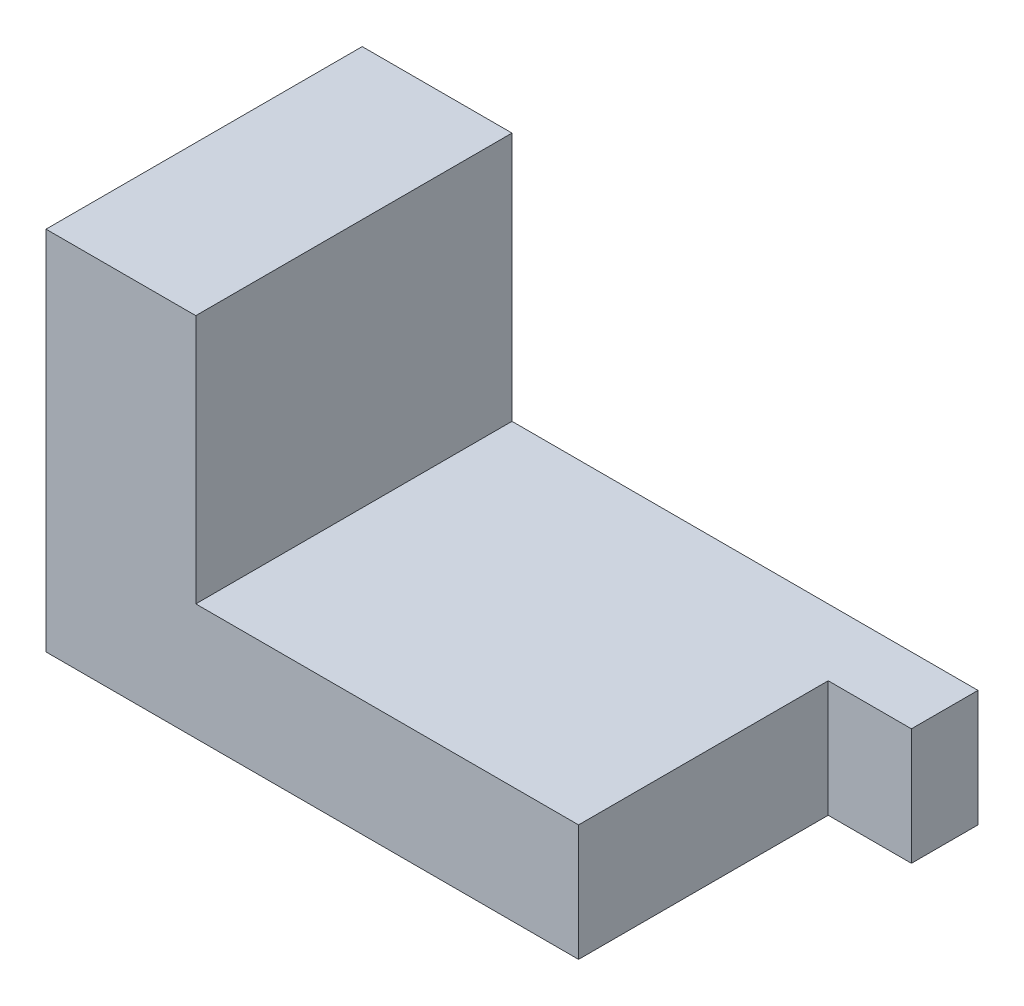
ISO-10303-21;
HEADER;
FILE_DESCRIPTION(('STEP AP214'),'2;1');
FILE_NAME('part.step','',(''),(''),'','','');
FILE_SCHEMA(('AUTOMOTIVE_DESIGN { 1 0 10303 214 1 1 1 1 }'));
ENDSEC;
DATA;
#1=APPLICATION_CONTEXT('core data for automotive mechanical design processes');
#2=APPLICATION_PROTOCOL_DEFINITION('international standard','automotive_design',2000,#1);
#3=PRODUCT_CONTEXT('',#1,'mechanical');
#4=PRODUCT('Part','Part','',(#3));
#5=PRODUCT_RELATED_PRODUCT_CATEGORY('part','',(#4));
#6=PRODUCT_DEFINITION_FORMATION('','',#4);
#7=PRODUCT_DEFINITION_CONTEXT('part definition',#1,'design');
#8=PRODUCT_DEFINITION('design','',#6,#7);
#9=PRODUCT_DEFINITION_SHAPE('','',#8);
#10=(LENGTH_UNIT() NAMED_UNIT(*) SI_UNIT(.MILLI.,.METRE.));
#11=(NAMED_UNIT(*) PLANE_ANGLE_UNIT() SI_UNIT($,.RADIAN.));
#12=(NAMED_UNIT(*) SI_UNIT($,.STERADIAN.) SOLID_ANGLE_UNIT());
#13=UNCERTAINTY_MEASURE_WITH_UNIT(LENGTH_MEASURE(1.E-05),#10,'distance_accuracy_value','');
#14=(GEOMETRIC_REPRESENTATION_CONTEXT(3) GLOBAL_UNCERTAINTY_ASSIGNED_CONTEXT((#13)) GLOBAL_UNIT_ASSIGNED_CONTEXT((#10,
#11,#12)) REPRESENTATION_CONTEXT('',''));
#15=CARTESIAN_POINT('',(0.,0.,0.));
#16=DIRECTION('',(0.,0.,1.));
#17=DIRECTION('',(1.,0.,0.));
#18=AXIS2_PLACEMENT_3D('',#15,#16,#17);
#19=CARTESIAN_POINT('',(16.,7.,-9.5));
#20=DIRECTION('',(-1.,0.,0.));
#21=DIRECTION('',(0.,0.,1.));
#22=AXIS2_PLACEMENT_3D('',#19,#20,#21);
#23=PLANE('',#22);
#24=DIRECTION('',(0.,-1.,0.));
#25=VECTOR('',#24,1.);
#26=CARTESIAN_POINT('',(16.,7.,-5.5));
#27=LINE('',#26,#25);
#28=CARTESIAN_POINT('',(16.,7.,-5.5));
#29=VERTEX_POINT('',#28);
#30=CARTESIAN_POINT('',(16.,0.,-5.5));
#31=VERTEX_POINT('',#30);
#32=EDGE_CURVE('E51',#29,#31,#27,.T.);
#33=ORIENTED_EDGE('',*,*,#32,.F.);
#34=DIRECTION('',(0.,0.,-1.));
#35=VECTOR('',#34,1.);
#36=CARTESIAN_POINT('',(16.,7.,-9.5));
#37=LINE('',#36,#35);
#38=CARTESIAN_POINT('',(16.,7.,9.5));
#39=VERTEX_POINT('',#38);
#40=EDGE_CURVE('E111',#39,#29,#37,.T.);
#41=ORIENTED_EDGE('',*,*,#40,.F.);
#42=DIRECTION('',(0.,-1.,0.));
#43=VECTOR('',#42,1.);
#44=CARTESIAN_POINT('',(16.,7.,9.5));
#45=LINE('',#44,#43);
#46=CARTESIAN_POINT('',(16.,0.,9.5));
#47=VERTEX_POINT('',#46);
#48=EDGE_CURVE('E154',#39,#47,#45,.T.);
#49=ORIENTED_EDGE('',*,*,#48,.T.);
#50=DIRECTION('',(0.,0.,-1.));
#51=VECTOR('',#50,1.);
#52=CARTESIAN_POINT('',(16.,0.,-9.5));
#53=LINE('',#52,#51);
#54=EDGE_CURVE('E150',#47,#31,#53,.T.);
#55=ORIENTED_EDGE('',*,*,#54,.T.);
#56=EDGE_LOOP('',(#33,#41,#49,#55));
#57=FACE_BOUND('',#56,.T.);
#58=ADVANCED_FACE('F37',(#57),#23,.F.);
#59=CARTESIAN_POINT('',(-16.,7.,-9.5));
#60=DIRECTION('',(0.,0.,1.));
#61=DIRECTION('',(1.,0.,0.));
#62=AXIS2_PLACEMENT_3D('',#59,#60,#61);
#63=PLANE('',#62);
#64=DIRECTION('',(-1.,0.,0.));
#65=VECTOR('',#64,1.);
#66=CARTESIAN_POINT('',(-16.,0.,-9.5));
#67=LINE('',#66,#65);
#68=CARTESIAN_POINT('',(21.,0.,-9.5));
#69=VERTEX_POINT('',#68);
#70=CARTESIAN_POINT('',(-16.,0.,-9.5));
#71=VERTEX_POINT('',#70);
#72=EDGE_CURVE('E156',#69,#71,#67,.T.);
#73=ORIENTED_EDGE('',*,*,#72,.T.);
#74=DIRECTION('',(0.,-1.,0.));
#75=VECTOR('',#74,1.);
#76=CARTESIAN_POINT('',(-16.,7.,-9.5));
#77=LINE('',#76,#75);
#78=CARTESIAN_POINT('',(-16.,22.,-9.5));
#79=VERTEX_POINT('',#78);
#80=EDGE_CURVE('E11',#79,#71,#77,.T.);
#81=ORIENTED_EDGE('',*,*,#80,.F.);
#82=DIRECTION('',(-1.,0.,0.));
#83=VECTOR('',#82,1.);
#84=CARTESIAN_POINT('',(-16.,22.,-9.5));
#85=LINE('',#84,#83);
#86=CARTESIAN_POINT('',(-7.,22.,-9.5));
#87=VERTEX_POINT('',#86);
#88=EDGE_CURVE('E142',#87,#79,#85,.T.);
#89=ORIENTED_EDGE('',*,*,#88,.F.);
#90=DIRECTION('',(0.,-1.,0.));
#91=VECTOR('',#90,1.);
#92=CARTESIAN_POINT('',(-7.,22.,-9.5));
#93=LINE('',#92,#91);
#94=CARTESIAN_POINT('',(-7.,7.,-9.5));
#95=VERTEX_POINT('',#94);
#96=EDGE_CURVE('E109',#87,#95,#93,.T.);
#97=ORIENTED_EDGE('',*,*,#96,.T.);
#98=DIRECTION('',(-1.,0.,0.));
#99=VECTOR('',#98,1.);
#100=CARTESIAN_POINT('',(-16.,7.,-9.5));
#101=LINE('',#100,#99);
#102=CARTESIAN_POINT('',(21.,7.,-9.5));
#103=VERTEX_POINT('',#102);
#104=EDGE_CURVE('E102',#103,#95,#101,.T.);
#105=ORIENTED_EDGE('',*,*,#104,.F.);
#106=DIRECTION('',(0.,1.,0.));
#107=VECTOR('',#106,1.);
#108=CARTESIAN_POINT('',(21.,7.,-9.5));
#109=LINE('',#108,#107);
#110=EDGE_CURVE('E106',#69,#103,#109,.T.);
#111=ORIENTED_EDGE('',*,*,#110,.F.);
#112=EDGE_LOOP('',(#73,#81,#89,#97,#105,#111));
#113=FACE_BOUND('',#112,.T.);
#114=ADVANCED_FACE('F104',(#113),#63,.F.);
#115=CARTESIAN_POINT('',(-16.,7.,-9.5));
#116=DIRECTION('',(1.,0.,0.));
#117=DIRECTION('',(0.,0.,-1.));
#118=AXIS2_PLACEMENT_3D('',#115,#116,#117);
#119=PLANE('',#118);
#120=DIRECTION('',(0.,0.,1.));
#121=VECTOR('',#120,1.);
#122=CARTESIAN_POINT('',(-16.,0.,-9.5));
#123=LINE('',#122,#121);
#124=CARTESIAN_POINT('',(-16.,0.,9.5));
#125=VERTEX_POINT('',#124);
#126=EDGE_CURVE('E158',#71,#125,#123,.T.);
#127=ORIENTED_EDGE('',*,*,#126,.T.);
#128=DIRECTION('',(0.,-1.,0.));
#129=VECTOR('',#128,1.);
#130=CARTESIAN_POINT('',(-16.,7.,9.5));
#131=LINE('',#130,#129);
#132=CARTESIAN_POINT('',(-16.,22.,9.5));
#133=VERTEX_POINT('',#132);
#134=EDGE_CURVE('E44',#133,#125,#131,.T.);
#135=ORIENTED_EDGE('',*,*,#134,.F.);
#136=DIRECTION('',(0.,0.,1.));
#137=VECTOR('',#136,1.);
#138=CARTESIAN_POINT('',(-16.,22.,-9.5));
#139=LINE('',#138,#137);
#140=EDGE_CURVE('E135',#79,#133,#139,.T.);
#141=ORIENTED_EDGE('',*,*,#140,.F.);
#142=ORIENTED_EDGE('',*,*,#80,.T.);
#143=EDGE_LOOP('',(#127,#135,#141,#142));
#144=FACE_BOUND('',#143,.T.);
#145=ADVANCED_FACE('F178',(#144),#119,.F.);
#146=CARTESIAN_POINT('',(-16.,7.,9.5));
#147=DIRECTION('',(0.,0.,-1.));
#148=DIRECTION('',(-1.,0.,0.));
#149=AXIS2_PLACEMENT_3D('',#146,#147,#148);
#150=PLANE('',#149);
#151=DIRECTION('',(1.,0.,0.));
#152=VECTOR('',#151,1.);
#153=CARTESIAN_POINT('',(-16.,0.,9.5));
#154=LINE('',#153,#152);
#155=EDGE_CURVE('E151',#125,#47,#154,.T.);
#156=ORIENTED_EDGE('',*,*,#155,.T.);
#157=ORIENTED_EDGE('',*,*,#48,.F.);
#158=DIRECTION('',(1.,0.,0.));
#159=VECTOR('',#158,1.);
#160=CARTESIAN_POINT('',(-16.,7.,9.5));
#161=LINE('',#160,#159);
#162=CARTESIAN_POINT('',(-7.,7.,9.5));
#163=VERTEX_POINT('',#162);
#164=EDGE_CURVE('E110',#163,#39,#161,.T.);
#165=ORIENTED_EDGE('',*,*,#164,.F.);
#166=DIRECTION('',(0.,-1.,0.));
#167=VECTOR('',#166,1.);
#168=CARTESIAN_POINT('',(-7.,22.,9.5));
#169=LINE('',#168,#167);
#170=CARTESIAN_POINT('',(-7.,22.,9.5));
#171=VERTEX_POINT('',#170);
#172=EDGE_CURVE('E147',#171,#163,#169,.T.);
#173=ORIENTED_EDGE('',*,*,#172,.F.);
#174=DIRECTION('',(1.,0.,0.));
#175=VECTOR('',#174,1.);
#176=CARTESIAN_POINT('',(-16.,22.,9.5));
#177=LINE('',#176,#175);
#178=EDGE_CURVE('E138',#133,#171,#177,.T.);
#179=ORIENTED_EDGE('',*,*,#178,.F.);
#180=ORIENTED_EDGE('',*,*,#134,.T.);
#181=EDGE_LOOP('',(#156,#157,#165,#173,#179,#180));
#182=FACE_BOUND('',#181,.T.);
#183=ADVANCED_FACE('F166',(#182),#150,.F.);
#184=CARTESIAN_POINT('',(0.,7.,0.));
#185=DIRECTION('',(0.,1.,0.));
#186=DIRECTION('',(0.,0.,1.));
#187=AXIS2_PLACEMENT_3D('',#184,#185,#186);
#188=PLANE('',#187);
#189=DIRECTION('',(0.,0.,-1.));
#190=VECTOR('',#189,1.);
#191=CARTESIAN_POINT('',(-7.,7.,-9.5));
#192=LINE('',#191,#190);
#193=EDGE_CURVE('E59',#163,#95,#192,.T.);
#194=ORIENTED_EDGE('',*,*,#193,.F.);
#195=ORIENTED_EDGE('',*,*,#164,.T.);
#196=ORIENTED_EDGE('',*,*,#40,.T.);
#197=DIRECTION('',(-1.,0.,0.));
#198=VECTOR('',#197,1.);
#199=CARTESIAN_POINT('',(21.,7.,-5.5));
#200=LINE('',#199,#198);
#201=CARTESIAN_POINT('',(21.,7.,-5.5));
#202=VERTEX_POINT('',#201);
#203=EDGE_CURVE('E117',#202,#29,#200,.T.);
#204=ORIENTED_EDGE('',*,*,#203,.F.);
#205=DIRECTION('',(0.,0.,1.));
#206=VECTOR('',#205,1.);
#207=CARTESIAN_POINT('',(21.,7.,-9.5));
#208=LINE('',#207,#206);
#209=EDGE_CURVE('E114',#103,#202,#208,.T.);
#210=ORIENTED_EDGE('',*,*,#209,.F.);
#211=ORIENTED_EDGE('',*,*,#104,.T.);
#212=EDGE_LOOP('',(#194,#195,#196,#204,#210,#211));
#213=FACE_BOUND('',#212,.T.);
#214=ADVANCED_FACE('F115',(#213),#188,.T.);
#215=CARTESIAN_POINT('',(0.,0.,0.));
#216=DIRECTION('',(0.,1.,0.));
#217=DIRECTION('',(0.,0.,1.));
#218=AXIS2_PLACEMENT_3D('',#215,#216,#217);
#219=PLANE('',#218);
#220=ORIENTED_EDGE('',*,*,#54,.F.);
#221=ORIENTED_EDGE('',*,*,#155,.F.);
#222=ORIENTED_EDGE('',*,*,#126,.F.);
#223=ORIENTED_EDGE('',*,*,#72,.F.);
#224=DIRECTION('',(0.,0.,-1.));
#225=VECTOR('',#224,1.);
#226=CARTESIAN_POINT('',(21.,0.,-9.5));
#227=LINE('',#226,#225);
#228=CARTESIAN_POINT('',(21.,0.,-5.5));
#229=VERTEX_POINT('',#228);
#230=EDGE_CURVE('E125',#229,#69,#227,.T.);
#231=ORIENTED_EDGE('',*,*,#230,.F.);
#232=DIRECTION('',(-1.,0.,0.));
#233=VECTOR('',#232,1.);
#234=CARTESIAN_POINT('',(21.,0.,-5.5));
#235=LINE('',#234,#233);
#236=EDGE_CURVE('E130',#229,#31,#235,.T.);
#237=ORIENTED_EDGE('',*,*,#236,.T.);
#238=EDGE_LOOP('',(#220,#221,#222,#223,#231,#237));
#239=FACE_BOUND('',#238,.T.);
#240=ADVANCED_FACE('F174',(#239),#219,.F.);
#241=CARTESIAN_POINT('',(-7.,22.,-9.5));
#242=DIRECTION('',(-1.,0.,0.));
#243=DIRECTION('',(0.,0.,1.));
#244=AXIS2_PLACEMENT_3D('',#241,#242,#243);
#245=PLANE('',#244);
#246=ORIENTED_EDGE('',*,*,#193,.T.);
#247=ORIENTED_EDGE('',*,*,#96,.F.);
#248=DIRECTION('',(0.,0.,-1.));
#249=VECTOR('',#248,1.);
#250=CARTESIAN_POINT('',(-7.,22.,-9.5));
#251=LINE('',#250,#249);
#252=EDGE_CURVE('E140',#171,#87,#251,.T.);
#253=ORIENTED_EDGE('',*,*,#252,.F.);
#254=ORIENTED_EDGE('',*,*,#172,.T.);
#255=EDGE_LOOP('',(#246,#247,#253,#254));
#256=FACE_BOUND('',#255,.T.);
#257=ADVANCED_FACE('F183',(#256),#245,.F.);
#258=CARTESIAN_POINT('',(0.,22.,0.));
#259=DIRECTION('',(0.,1.,0.));
#260=DIRECTION('',(0.,0.,1.));
#261=AXIS2_PLACEMENT_3D('',#258,#259,#260);
#262=PLANE('',#261);
#263=ORIENTED_EDGE('',*,*,#140,.T.);
#264=ORIENTED_EDGE('',*,*,#178,.T.);
#265=ORIENTED_EDGE('',*,*,#252,.T.);
#266=ORIENTED_EDGE('',*,*,#88,.T.);
#267=EDGE_LOOP('',(#263,#264,#265,#266));
#268=FACE_BOUND('',#267,.T.);
#269=ADVANCED_FACE('F180',(#268),#262,.T.);
#270=CARTESIAN_POINT('',(21.,7.,-5.5));
#271=DIRECTION('',(0.,0.,-1.));
#272=DIRECTION('',(-1.,0.,0.));
#273=AXIS2_PLACEMENT_3D('',#270,#271,#272);
#274=PLANE('',#273);
#275=ORIENTED_EDGE('',*,*,#32,.T.);
#276=ORIENTED_EDGE('',*,*,#236,.F.);
#277=DIRECTION('',(0.,-1.,0.));
#278=VECTOR('',#277,1.);
#279=CARTESIAN_POINT('',(21.,7.,-5.5));
#280=LINE('',#279,#278);
#281=EDGE_CURVE('E120',#202,#229,#280,.T.);
#282=ORIENTED_EDGE('',*,*,#281,.F.);
#283=ORIENTED_EDGE('',*,*,#203,.T.);
#284=EDGE_LOOP('',(#275,#276,#282,#283));
#285=FACE_BOUND('',#284,.T.);
#286=ADVANCED_FACE('F177',(#285),#274,.F.);
#287=CARTESIAN_POINT('',(21.,0.,0.));
#288=DIRECTION('',(-1.,0.,0.));
#289=DIRECTION('',(0.,0.,1.));
#290=AXIS2_PLACEMENT_3D('',#287,#288,#289);
#291=PLANE('',#290);
#292=ORIENTED_EDGE('',*,*,#110,.T.);
#293=ORIENTED_EDGE('',*,*,#209,.T.);
#294=ORIENTED_EDGE('',*,*,#281,.T.);
#295=ORIENTED_EDGE('',*,*,#230,.T.);
#296=EDGE_LOOP('',(#292,#293,#294,#295));
#297=FACE_BOUND('',#296,.T.);
#298=ADVANCED_FACE('F123',(#297),#291,.F.);
#299=CLOSED_SHELL('',(#58,#114,#145,#183,#214,#240,#257,#269,#286,#298));
#300=MANIFOLD_SOLID_BREP('B2',#299);
#301=ADVANCED_BREP_SHAPE_REPRESENTATION('',(#18,#300),#14);
#302=SHAPE_DEFINITION_REPRESENTATION(#9,#301);
ENDSEC;
END-ISO-10303-21;
